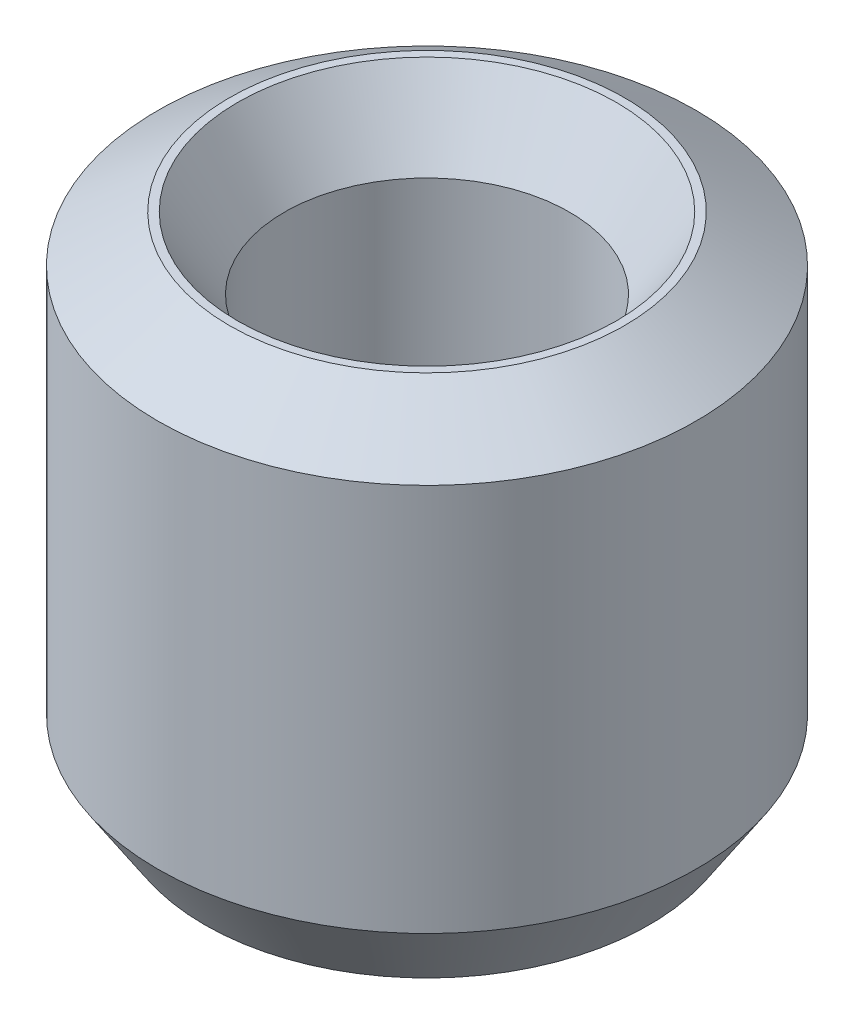
ISO-10303-21;
HEADER;
FILE_DESCRIPTION(('STEP AP214'),'2;1');
FILE_NAME('part.step','',(''),(''),'','','');
FILE_SCHEMA(('AUTOMOTIVE_DESIGN { 1 0 10303 214 1 1 1 1 }'));
ENDSEC;
DATA;
#1=APPLICATION_CONTEXT('core data for automotive mechanical design processes');
#2=APPLICATION_PROTOCOL_DEFINITION('international standard','automotive_design',2000,#1);
#3=PRODUCT_CONTEXT('',#1,'mechanical');
#4=PRODUCT('Part','Part','',(#3));
#5=PRODUCT_RELATED_PRODUCT_CATEGORY('part','',(#4));
#6=PRODUCT_DEFINITION_FORMATION('','',#4);
#7=PRODUCT_DEFINITION_CONTEXT('part definition',#1,'design');
#8=PRODUCT_DEFINITION('design','',#6,#7);
#9=PRODUCT_DEFINITION_SHAPE('','',#8);
#10=(LENGTH_UNIT() NAMED_UNIT(*) SI_UNIT(.MILLI.,.METRE.));
#11=(NAMED_UNIT(*) PLANE_ANGLE_UNIT() SI_UNIT($,.RADIAN.));
#12=(NAMED_UNIT(*) SI_UNIT($,.STERADIAN.) SOLID_ANGLE_UNIT());
#13=UNCERTAINTY_MEASURE_WITH_UNIT(LENGTH_MEASURE(1.E-05),#10,'distance_accuracy_value','');
#14=(GEOMETRIC_REPRESENTATION_CONTEXT(3) GLOBAL_UNCERTAINTY_ASSIGNED_CONTEXT((#13)) GLOBAL_UNIT_ASSIGNED_CONTEXT((#10,
#11,#12)) REPRESENTATION_CONTEXT('',''));
#15=CARTESIAN_POINT('',(0.,0.,0.));
#16=DIRECTION('',(0.,0.,1.));
#17=DIRECTION('',(1.,0.,0.));
#18=AXIS2_PLACEMENT_3D('',#15,#16,#17);
#19=CARTESIAN_POINT('',(0.,37.6419727467282,0.));
#20=DIRECTION('',(0.,-1.,0.));
#21=DIRECTION('',(0.,0.,-1.));
#22=AXIS2_PLACEMENT_3D('',#19,#20,#21);
#23=CYLINDRICAL_SURFACE('',#22,20.);
#24=CARTESIAN_POINT('',(0.,5.32278416525543,0.));
#25=DIRECTION('',(0.,1.,0.));
#26=DIRECTION('',(0.,0.,1.));
#27=AXIS2_PLACEMENT_3D('',#24,#25,#26);
#28=CIRCLE('',#27,20.);
#29=CARTESIAN_POINT('',(0.,5.32278416525543,20.));
#30=VERTEX_POINT('',#29);
#31=EDGE_CURVE('E10',#30,#30,#28,.T.);
#32=ORIENTED_EDGE('',*,*,#31,.T.);
#33=EDGE_LOOP('',(#32));
#34=FACE_BOUND('',#33,.T.);
#35=CARTESIAN_POINT('',(0.,34.1632047486959,0.));
#36=DIRECTION('',(0.,1.,0.));
#37=DIRECTION('',(0.,0.,1.));
#38=AXIS2_PLACEMENT_3D('',#35,#36,#37);
#39=CIRCLE('',#38,20.);
#40=CARTESIAN_POINT('',(0.,34.1632047486959,20.));
#41=VERTEX_POINT('',#40);
#42=EDGE_CURVE('E50',#41,#41,#39,.F.);
#43=ORIENTED_EDGE('',*,*,#42,.T.);
#44=EDGE_LOOP('',(#43));
#45=FACE_BOUND('',#44,.T.);
#46=ADVANCED_FACE('F39',(#34,#45),#23,.T.);
#47=CARTESIAN_POINT('',(0.,37.6419727467282,0.));
#48=DIRECTION('',(0.,1.,0.));
#49=DIRECTION('',(0.,0.,1.));
#50=AXIS2_PLACEMENT_3D('',#47,#48,#49);
#51=PLANE('',#50);
#52=CARTESIAN_POINT('',(0.,37.6419727467282,0.));
#53=DIRECTION('',(0.,1.,0.));
#54=DIRECTION('',(0.,0.,1.));
#55=AXIS2_PLACEMENT_3D('',#52,#53,#54);
#56=CIRCLE('',#55,14.0705998807368);
#57=CARTESIAN_POINT('',(0.,37.6419727467282,14.0705998807368));
#58=VERTEX_POINT('',#57);
#59=EDGE_CURVE('E58',#58,#58,#56,.F.);
#60=ORIENTED_EDGE('',*,*,#59,.T.);
#61=EDGE_LOOP('',(#60));
#62=FACE_BOUND('',#61,.T.);
#63=CARTESIAN_POINT('',(0.,37.6419727467282,0.));
#64=DIRECTION('',(0.,1.,0.));
#65=DIRECTION('',(0.,0.,1.));
#66=AXIS2_PLACEMENT_3D('',#63,#64,#65);
#67=CIRCLE('',#66,14.6772158347446);
#68=CARTESIAN_POINT('',(0.,37.6419727467282,14.6772158347446));
#69=VERTEX_POINT('',#68);
#70=EDGE_CURVE('E61',#69,#69,#67,.T.);
#71=ORIENTED_EDGE('',*,*,#70,.T.);
#72=EDGE_LOOP('',(#71));
#73=FACE_BOUND('',#72,.T.);
#74=ADVANCED_FACE('F88',(#62,#73),#51,.T.);
#75=CARTESIAN_POINT('',(0.,0.,0.));
#76=DIRECTION('',(0.,1.,0.));
#77=DIRECTION('',(0.,0.,1.));
#78=AXIS2_PLACEMENT_3D('',#75,#76,#77);
#79=PLANE('',#78);
#80=CARTESIAN_POINT('',(0.,0.,0.));
#81=DIRECTION('',(0.,1.,0.));
#82=DIRECTION('',(0.,0.,1.));
#83=AXIS2_PLACEMENT_3D('',#80,#81,#82);
#84=CIRCLE('',#83,15.9146160479599);
#85=CARTESIAN_POINT('',(0.,0.,15.9146160479599));
#86=VERTEX_POINT('',#85);
#87=EDGE_CURVE('E51',#86,#86,#84,.T.);
#88=ORIENTED_EDGE('',*,*,#87,.T.);
#89=EDGE_LOOP('',(#88));
#90=FACE_BOUND('',#89,.T.);
#91=CARTESIAN_POINT('',(0.,0.,0.));
#92=DIRECTION('',(0.,1.,0.));
#93=DIRECTION('',(0.,0.,1.));
#94=AXIS2_PLACEMENT_3D('',#91,#92,#93);
#95=CIRCLE('',#94,16.5212320019677);
#96=CARTESIAN_POINT('',(0.,0.,16.5212320019677));
#97=VERTEX_POINT('',#96);
#98=EDGE_CURVE('E54',#97,#97,#95,.F.);
#99=ORIENTED_EDGE('',*,*,#98,.T.);
#100=EDGE_LOOP('',(#99));
#101=FACE_BOUND('',#100,.T.);
#102=ADVANCED_FACE('F83',(#90,#101),#79,.F.);
#103=CARTESIAN_POINT('',(0.,37.6419727467282,0.));
#104=DIRECTION('',(0.,-1.,0.));
#105=DIRECTION('',(0.,0.,-1.));
#106=AXIS2_PLACEMENT_3D('',#103,#104,#105);
#107=CYLINDRICAL_SURFACE('',#106,10.5918318827045);
#108=CARTESIAN_POINT('',(0.,32.3191885814728,0.));
#109=DIRECTION('',(0.,1.,0.));
#110=DIRECTION('',(0.,0.,1.));
#111=AXIS2_PLACEMENT_3D('',#108,#109,#110);
#112=CIRCLE('',#111,10.5918318827045);
#113=CARTESIAN_POINT('',(0.,32.3191885814728,10.5918318827045));
#114=VERTEX_POINT('',#113);
#115=EDGE_CURVE('E67',#114,#114,#112,.T.);
#116=ORIENTED_EDGE('',*,*,#115,.T.);
#117=EDGE_LOOP('',(#116));
#118=FACE_BOUND('',#117,.T.);
#119=CARTESIAN_POINT('',(0.,3.47876799803232,0.));
#120=DIRECTION('',(0.,1.,0.));
#121=DIRECTION('',(0.,0.,1.));
#122=AXIS2_PLACEMENT_3D('',#119,#120,#121);
#123=CIRCLE('',#122,10.5918318827045);
#124=CARTESIAN_POINT('',(0.,3.47876799803232,10.5918318827045));
#125=VERTEX_POINT('',#124);
#126=EDGE_CURVE('E69',#125,#125,#123,.F.);
#127=ORIENTED_EDGE('',*,*,#126,.T.);
#128=EDGE_LOOP('',(#127));
#129=FACE_BOUND('',#128,.T.);
#130=ADVANCED_FACE('F71',(#118,#129),#107,.F.);
#131=CARTESIAN_POINT('',(0.,32.3191885814728,0.));
#132=DIRECTION('',(0.,1.,0.));
#133=DIRECTION('',(0.,0.,1.));
#134=AXIS2_PLACEMENT_3D('',#131,#132,#133);
#135=CONICAL_SURFACE('',#134,10.5918318827045,0.578874995474263);
#136=ORIENTED_EDGE('',*,*,#59,.F.);
#137=EDGE_LOOP('',(#136));
#138=FACE_BOUND('',#137,.T.);
#139=ORIENTED_EDGE('',*,*,#115,.F.);
#140=EDGE_LOOP('',(#139));
#141=FACE_BOUND('',#140,.T.);
#142=ADVANCED_FACE('F77',(#138,#141),#135,.F.);
#143=CARTESIAN_POINT('',(0.,0.,0.));
#144=DIRECTION('',(0.,-1.,0.));
#145=DIRECTION('',(0.,0.,-1.));
#146=AXIS2_PLACEMENT_3D('',#143,#144,#145);
#147=CONICAL_SURFACE('',#146,15.9146160479599,0.991921331320635);
#148=ORIENTED_EDGE('',*,*,#126,.F.);
#149=EDGE_LOOP('',(#148));
#150=FACE_BOUND('',#149,.T.);
#151=ORIENTED_EDGE('',*,*,#87,.F.);
#152=EDGE_LOOP('',(#151));
#153=FACE_BOUND('',#152,.T.);
#154=ADVANCED_FACE('F73',(#150,#153),#147,.F.);
#155=CARTESIAN_POINT('',(0.,5.32278416525543,0.));
#156=DIRECTION('',(0.,1.,0.));
#157=DIRECTION('',(0.,0.,1.));
#158=AXIS2_PLACEMENT_3D('',#155,#156,#157);
#159=CONICAL_SURFACE('',#158,20.,0.578874995474262);
#160=ORIENTED_EDGE('',*,*,#98,.F.);
#161=EDGE_LOOP('',(#160));
#162=FACE_BOUND('',#161,.T.);
#163=ORIENTED_EDGE('',*,*,#31,.F.);
#164=EDGE_LOOP('',(#163));
#165=FACE_BOUND('',#164,.T.);
#166=ADVANCED_FACE('F76',(#162,#165),#159,.T.);
#167=CARTESIAN_POINT('',(0.,37.6419727467282,0.));
#168=DIRECTION('',(0.,-1.,0.));
#169=DIRECTION('',(0.,0.,-1.));
#170=AXIS2_PLACEMENT_3D('',#167,#168,#169);
#171=CONICAL_SURFACE('',#170,14.6772158347446,0.991921331320633);
#172=ORIENTED_EDGE('',*,*,#42,.F.);
#173=EDGE_LOOP('',(#172));
#174=FACE_BOUND('',#173,.T.);
#175=ORIENTED_EDGE('',*,*,#70,.F.);
#176=EDGE_LOOP('',(#175));
#177=FACE_BOUND('',#176,.T.);
#178=ADVANCED_FACE('F45',(#174,#177),#171,.T.);
#179=CLOSED_SHELL('',(#46,#74,#102,#130,#142,#154,#166,#178));
#180=MANIFOLD_SOLID_BREP('B2',#179);
#181=ADVANCED_BREP_SHAPE_REPRESENTATION('',(#18,#180),#14);
#182=SHAPE_DEFINITION_REPRESENTATION(#9,#181);
ENDSEC;
END-ISO-10303-21;
